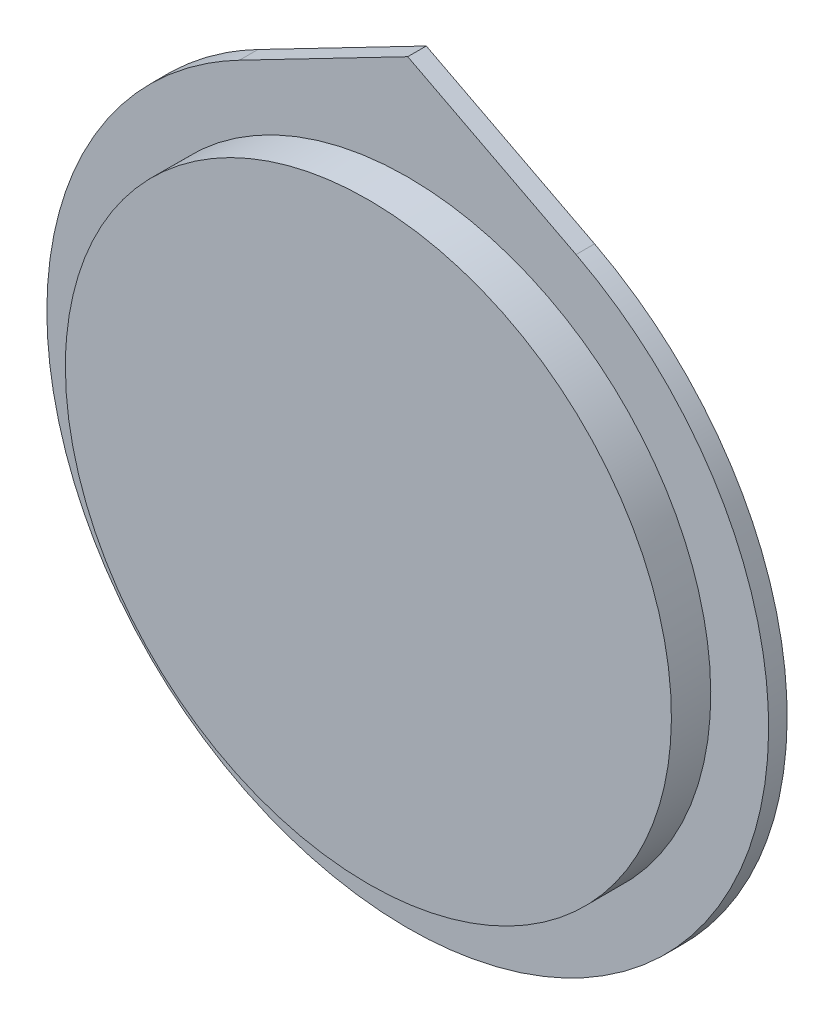
ISO-10303-21;
HEADER;
FILE_DESCRIPTION(('STEP AP214'),'2;1');
FILE_NAME('part.step','',(''),(''),'','','');
FILE_SCHEMA(('AUTOMOTIVE_DESIGN { 1 0 10303 214 1 1 1 1 }'));
ENDSEC;
DATA;
#1=APPLICATION_CONTEXT('core data for automotive mechanical design processes');
#2=APPLICATION_PROTOCOL_DEFINITION('international standard','automotive_design',2000,#1);
#3=PRODUCT_CONTEXT('',#1,'mechanical');
#4=PRODUCT('Part','Part','',(#3));
#5=PRODUCT_RELATED_PRODUCT_CATEGORY('part','',(#4));
#6=PRODUCT_DEFINITION_FORMATION('','',#4);
#7=PRODUCT_DEFINITION_CONTEXT('part definition',#1,'design');
#8=PRODUCT_DEFINITION('design','',#6,#7);
#9=PRODUCT_DEFINITION_SHAPE('','',#8);
#10=(LENGTH_UNIT() NAMED_UNIT(*) SI_UNIT(.MILLI.,.METRE.));
#11=(NAMED_UNIT(*) PLANE_ANGLE_UNIT() SI_UNIT($,.RADIAN.));
#12=(NAMED_UNIT(*) SI_UNIT($,.STERADIAN.) SOLID_ANGLE_UNIT());
#13=UNCERTAINTY_MEASURE_WITH_UNIT(LENGTH_MEASURE(1.E-05),#10,'distance_accuracy_value','');
#14=(GEOMETRIC_REPRESENTATION_CONTEXT(3) GLOBAL_UNCERTAINTY_ASSIGNED_CONTEXT((#13)) GLOBAL_UNIT_ASSIGNED_CONTEXT((#10,
#11,#12)) REPRESENTATION_CONTEXT('',''));
#15=CARTESIAN_POINT('',(0.,0.,0.));
#16=DIRECTION('',(0.,0.,1.));
#17=DIRECTION('',(1.,0.,0.));
#18=AXIS2_PLACEMENT_3D('',#15,#16,#17);
#19=CARTESIAN_POINT('',(0.,0.,3.175));
#20=DIRECTION('',(0.,0.,1.));
#21=DIRECTION('',(-1.,0.,0.));
#22=AXIS2_PLACEMENT_3D('',#19,#20,#21);
#23=ELLIPSE('',#22,16.6243,16.256);
#24=DIRECTION('',(0.,0.,-1.));
#25=VECTOR('',#24,1.);
#26=SURFACE_OF_LINEAR_EXTRUSION('',#23,#25);
#27=CARTESIAN_POINT('',(0.,0.,1.016));
#28=DIRECTION('',(0.,0.,-1.));
#29=DIRECTION('',(-1.,0.,0.));
#30=AXIS2_PLACEMENT_3D('',#27,#28,#29);
#31=ELLIPSE('',#30,16.6243,16.256);
#32=CARTESIAN_POINT('',(-16.6243,0.,1.016));
#33=VERTEX_POINT('',#32);
#34=EDGE_CURVE('E88',#33,#33,#31,.T.);
#35=ORIENTED_EDGE('',*,*,#34,.F.);
#36=EDGE_LOOP('',(#35));
#37=FACE_BOUND('',#36,.T.);
#38=CARTESIAN_POINT('',(-16.6243,0.,3.175));
#39=VERTEX_POINT('',#38);
#40=EDGE_CURVE('E11',#39,#39,#23,.T.);
#41=ORIENTED_EDGE('',*,*,#40,.F.);
#42=EDGE_LOOP('',(#41));
#43=FACE_BOUND('',#42,.T.);
#44=ADVANCED_FACE('F37',(#37,#43),#26,.F.);
#45=CARTESIAN_POINT('',(0.,0.,3.175));
#46=DIRECTION('',(0.,0.,1.));
#47=DIRECTION('',(1.,0.,0.));
#48=AXIS2_PLACEMENT_3D('',#45,#46,#47);
#49=PLANE('',#48);
#50=ORIENTED_EDGE('',*,*,#40,.T.);
#51=EDGE_LOOP('',(#50));
#52=FACE_BOUND('',#51,.T.);
#53=ADVANCED_FACE('F108',(#52),#49,.T.);
#54=CARTESIAN_POINT('',(-19.7993,0.,1.016));
#55=CARTESIAN_POINT('',(-19.7993,2.5524838983701,1.016));
#56=CARTESIAN_POINT('',(-18.7598707872041,7.65745169511031,1.016));
#57=CARTESIAN_POINT('',(-14.3357492299195,14.1259995077639,1.016));
#58=CARTESIAN_POINT('',(-7.74672759262551,18.4273319832868,1.016));
#59=CARTESIAN_POINT('',(0.,19.9328340083566,1.016));
#60=CARTESIAN_POINT('',(7.74672759262551,18.4273319832868,1.016));
#61=CARTESIAN_POINT('',(14.3357492299195,14.1259995077639,1.016));
#62=CARTESIAN_POINT('',(18.7598707872041,7.65745169511031,1.016));
#63=CARTESIAN_POINT('',(20.3190146063979,0.,1.016));
#64=CARTESIAN_POINT('',(18.7598707872041,-7.65745169511031,1.016));
#65=CARTESIAN_POINT('',(14.3357492299195,-14.1259995077639,1.016));
#66=CARTESIAN_POINT('',(7.74672759262551,-18.4273319832868,1.016));
#67=CARTESIAN_POINT('',(0.,-19.9328340083566,1.016));
#68=CARTESIAN_POINT('',(-7.74672759262551,-18.4273319832868,1.016));
#69=CARTESIAN_POINT('',(-14.3357492299195,-14.1259995077639,1.016));
#70=CARTESIAN_POINT('',(-18.7598707872041,-7.65745169511032,1.016));
#71=CARTESIAN_POINT('',(-19.7993,-2.55248389837011,1.016));
#72=CARTESIAN_POINT('',(-19.7993,0.,1.016));
#73=B_SPLINE_CURVE_WITH_KNOTS('',3,(#54,#55,#56,#57,#58,#59,#60,#61,#62,#63,#64,#65,#66,#67,#68,
#69,#70,#71,#72),.UNSPECIFIED.,.T.,.F.,(4,1,1,1,1,1,1,1,1,1,1,1,1,1,1,1,4),(0.,
0.392699081698724,0.785398163397448,1.17809724509617,1.5707963267949,1.96349540849362,
2.35619449019234,2.74889357189107,3.14159265358979,3.53429173528852,3.92699081698724,
4.31968989868597,4.71238898038469,5.10508806208341,5.49778714378214,5.89048622548086,
6.28318530717959),.UNSPECIFIED.);
#74=DIRECTION('',(0.,0.,-1.));
#75=VECTOR('',#74,1.);
#76=SURFACE_OF_LINEAR_EXTRUSION('',#73,#75);
#77=DIRECTION('',(0.,0.,-1.));
#78=VECTOR('',#77,1.);
#79=CARTESIAN_POINT('',(9.23376715274159,17.1878711893353,20.7793573979629));
#80=LINE('',#79,#78);
#81=CARTESIAN_POINT('',(9.23376715274159,17.1878711893353,1.016));
#82=VERTEX_POINT('',#81);
#83=CARTESIAN_POINT('',(9.23376211899133,17.1878737968375,0.));
#84=VERTEX_POINT('',#83);
#85=EDGE_CURVE('E76',#82,#84,#80,.T.);
#86=ORIENTED_EDGE('',*,*,#85,.F.);
#87=CARTESIAN_POINT('',(-9.23376715651503,17.1878711873807,1.016));
#88=VERTEX_POINT('',#87);
#89=EDGE_CURVE('E45',#82,#88,#73,.T.);
#90=ORIENTED_EDGE('',*,*,#89,.T.);
#91=DIRECTION('',(0.,0.,-1.));
#92=VECTOR('',#91,1.);
#93=CARTESIAN_POINT('',(-9.23376715274159,17.1878711893353,20.7793573979629));
#94=LINE('',#93,#92);
#95=CARTESIAN_POINT('',(-9.23376715651503,17.1878711873807,0.));
#96=VERTEX_POINT('',#95);
#97=EDGE_CURVE('E86',#88,#96,#94,.T.);
#98=ORIENTED_EDGE('',*,*,#97,.T.);
#99=CARTESIAN_POINT('',(-19.7993,0.,0.));
#100=CARTESIAN_POINT('',(-19.7993,2.5524838983701,0.));
#101=CARTESIAN_POINT('',(-18.7598707872041,7.65745169511031,0.));
#102=CARTESIAN_POINT('',(-14.3357492299195,14.1259995077639,0.));
#103=CARTESIAN_POINT('',(-7.74672759262551,18.4273319832868,0.));
#104=CARTESIAN_POINT('',(0.,19.9328340083566,0.));
#105=CARTESIAN_POINT('',(7.74672759262551,18.4273319832868,0.));
#106=CARTESIAN_POINT('',(14.3357492299195,14.1259995077639,0.));
#107=CARTESIAN_POINT('',(18.7598707872041,7.65745169511031,0.));
#108=CARTESIAN_POINT('',(20.3190146063979,0.,0.));
#109=CARTESIAN_POINT('',(18.7598707872041,-7.65745169511031,0.));
#110=CARTESIAN_POINT('',(14.3357492299195,-14.1259995077639,0.));
#111=CARTESIAN_POINT('',(7.74672759262551,-18.4273319832868,0.));
#112=CARTESIAN_POINT('',(0.,-19.9328340083566,0.));
#113=CARTESIAN_POINT('',(-7.74672759262551,-18.4273319832868,0.));
#114=CARTESIAN_POINT('',(-14.3357492299195,-14.1259995077639,0.));
#115=CARTESIAN_POINT('',(-18.7598707872041,-7.65745169511032,0.));
#116=CARTESIAN_POINT('',(-19.7993,-2.55248389837011,0.));
#117=CARTESIAN_POINT('',(-19.7993,0.,0.));
#118=B_SPLINE_CURVE_WITH_KNOTS('',3,(#99,#100,#101,#102,#103,#104,#105,#106,#107,#108,#109,#110,
#111,#112,#113,#114,#115,#116,#117),.UNSPECIFIED.,.T.,.F.,(4,1,1,1,1,1,1,1,1,1,1,1,1,1,1,1,4),
(0.,0.392699081698724,0.785398163397448,1.17809724509617,1.5707963267949,1.96349540849362,
2.35619449019234,2.74889357189107,3.14159265358979,3.53429173528852,3.92699081698724,
4.31968989868597,4.71238898038469,5.10508806208341,5.49778714378214,5.89048622548086,
6.28318530717959),.UNSPECIFIED.);
#119=EDGE_CURVE('E56',#84,#96,#118,.T.);
#120=ORIENTED_EDGE('',*,*,#119,.F.);
#121=EDGE_LOOP('',(#86,#90,#98,#120));
#122=FACE_BOUND('',#121,.T.);
#123=ADVANCED_FACE('F77',(#122),#76,.T.);
#124=CARTESIAN_POINT('',(19.7993,0.,1.016));
#125=DIRECTION('',(0.,0.,1.));
#126=DIRECTION('',(1.,0.,0.));
#127=AXIS2_PLACEMENT_3D('',#124,#125,#126);
#128=PLANE('',#127);
#129=ORIENTED_EDGE('',*,*,#89,.F.);
#130=DIRECTION('',(-0.887941135277039,0.459957107003384,0.));
#131=VECTOR('',#130,1.);
#132=CARTESIAN_POINT('',(9.23376715274159,17.1878711893353,1.016));
#133=LINE('',#132,#131);
#134=CARTESIAN_POINT('',(0.,21.971,1.016));
#135=VERTEX_POINT('',#134);
#136=EDGE_CURVE('E73',#82,#135,#133,.T.);
#137=ORIENTED_EDGE('',*,*,#136,.T.);
#138=DIRECTION('',(-0.887941135277039,-0.459957107003384,0.));
#139=VECTOR('',#138,1.);
#140=CARTESIAN_POINT('',(0.,21.971,1.016));
#141=LINE('',#140,#139);
#142=EDGE_CURVE('E74',#135,#88,#141,.T.);
#143=ORIENTED_EDGE('',*,*,#142,.T.);
#144=EDGE_LOOP('',(#129,#137,#143));
#145=FACE_BOUND('',#144,.T.);
#146=ORIENTED_EDGE('',*,*,#34,.T.);
#147=EDGE_LOOP('',(#146));
#148=FACE_BOUND('',#147,.T.);
#149=ADVANCED_FACE('F70',(#145,#148),#128,.T.);
#150=CARTESIAN_POINT('',(0.,0.,0.));
#151=DIRECTION('',(0.,0.,1.));
#152=DIRECTION('',(1.,0.,0.));
#153=AXIS2_PLACEMENT_3D('',#150,#151,#152);
#154=PLANE('',#153);
#155=ORIENTED_EDGE('',*,*,#119,.T.);
#156=DIRECTION('',(-0.887941135277039,-0.459957107003384,0.));
#157=VECTOR('',#156,1.);
#158=CARTESIAN_POINT('',(0.,21.971,0.));
#159=LINE('',#158,#157);
#160=CARTESIAN_POINT('',(0.,21.971,0.));
#161=VERTEX_POINT('',#160);
#162=EDGE_CURVE('E90',#161,#96,#159,.T.);
#163=ORIENTED_EDGE('',*,*,#162,.F.);
#164=DIRECTION('',(-0.887941135277039,0.459957107003384,0.));
#165=VECTOR('',#164,1.);
#166=CARTESIAN_POINT('',(9.23376715274159,17.1878711893353,0.));
#167=LINE('',#166,#165);
#168=EDGE_CURVE('E81',#84,#161,#167,.T.);
#169=ORIENTED_EDGE('',*,*,#168,.F.);
#170=EDGE_LOOP('',(#155,#163,#169));
#171=FACE_BOUND('',#170,.T.);
#172=ADVANCED_FACE('F112',(#171),#154,.F.);
#173=CARTESIAN_POINT('',(9.23376715274159,17.1878711893353,20.7793573979629));
#174=DIRECTION('',(-0.459957107003384,-0.887941135277039,0.));
#175=DIRECTION('',(0.88794113527704,-0.459957107003384,0.));
#176=AXIS2_PLACEMENT_3D('',#173,#174,#175);
#177=PLANE('',#176);
#178=ORIENTED_EDGE('',*,*,#136,.F.);
#179=ORIENTED_EDGE('',*,*,#85,.T.);
#180=ORIENTED_EDGE('',*,*,#168,.T.);
#181=DIRECTION('',(0.,0.,-1.));
#182=VECTOR('',#181,1.);
#183=CARTESIAN_POINT('',(0.,21.971,20.7793573979629));
#184=LINE('',#183,#182);
#185=EDGE_CURVE('E85',#135,#161,#184,.T.);
#186=ORIENTED_EDGE('',*,*,#185,.F.);
#187=EDGE_LOOP('',(#178,#179,#180,#186));
#188=FACE_BOUND('',#187,.T.);
#189=ADVANCED_FACE('F84',(#188),#177,.F.);
#190=CARTESIAN_POINT('',(0.,21.971,20.7793573979629));
#191=DIRECTION('',(0.459957107003384,-0.887941135277039,0.));
#192=DIRECTION('',(0.887941135277039,0.459957107003384,0.));
#193=AXIS2_PLACEMENT_3D('',#190,#191,#192);
#194=PLANE('',#193);
#195=ORIENTED_EDGE('',*,*,#142,.F.);
#196=ORIENTED_EDGE('',*,*,#185,.T.);
#197=ORIENTED_EDGE('',*,*,#162,.T.);
#198=ORIENTED_EDGE('',*,*,#97,.F.);
#199=EDGE_LOOP('',(#195,#196,#197,#198));
#200=FACE_BOUND('',#199,.T.);
#201=ADVANCED_FACE('F119',(#200),#194,.F.);
#202=CLOSED_SHELL('',(#44,#53,#123,#149,#172,#189,#201));
#203=MANIFOLD_SOLID_BREP('B2',#202);
#204=ADVANCED_BREP_SHAPE_REPRESENTATION('',(#18,#203),#14);
#205=SHAPE_DEFINITION_REPRESENTATION(#9,#204);
ENDSEC;
END-ISO-10303-21;
